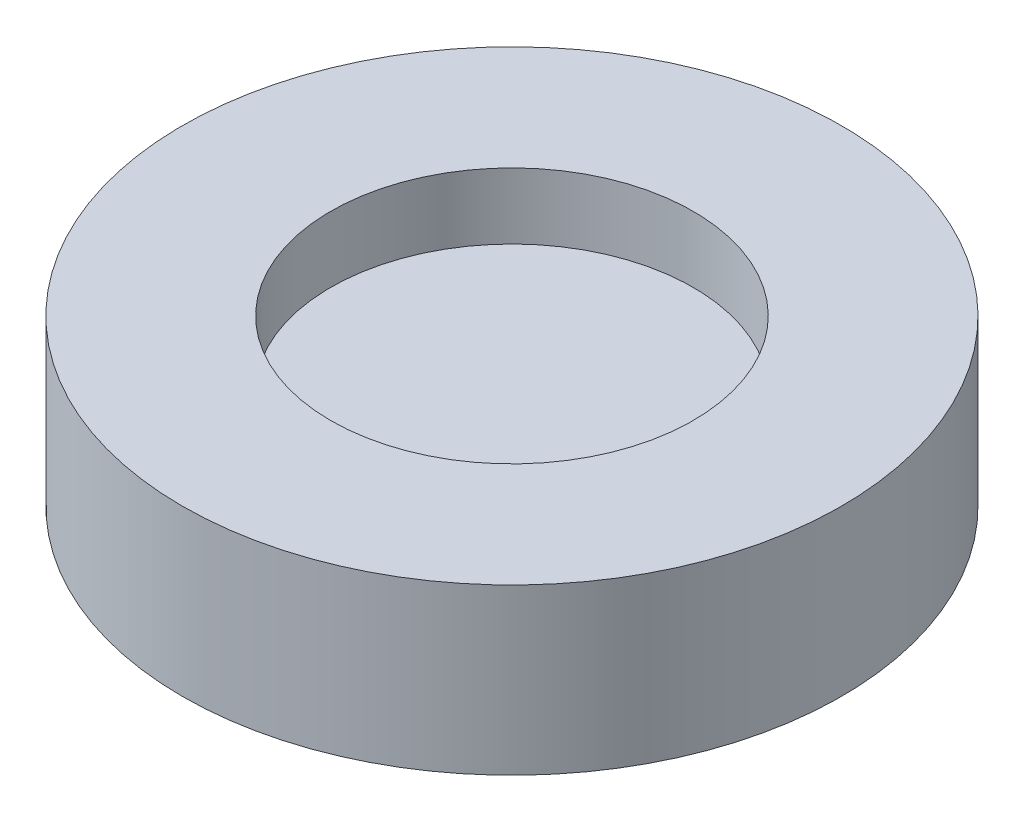
ISO-10303-21;
HEADER;
FILE_DESCRIPTION(('STEP AP214'),'2;1');
FILE_NAME('part.step','',(''),(''),'','','');
FILE_SCHEMA(('AUTOMOTIVE_DESIGN { 1 0 10303 214 1 1 1 1 }'));
ENDSEC;
DATA;
#1=APPLICATION_CONTEXT('core data for automotive mechanical design processes');
#2=APPLICATION_PROTOCOL_DEFINITION('international standard','automotive_design',2000,#1);
#3=PRODUCT_CONTEXT('',#1,'mechanical');
#4=PRODUCT('Part','Part','',(#3));
#5=PRODUCT_RELATED_PRODUCT_CATEGORY('part','',(#4));
#6=PRODUCT_DEFINITION_FORMATION('','',#4);
#7=PRODUCT_DEFINITION_CONTEXT('part definition',#1,'design');
#8=PRODUCT_DEFINITION('design','',#6,#7);
#9=PRODUCT_DEFINITION_SHAPE('','',#8);
#10=(LENGTH_UNIT() NAMED_UNIT(*) SI_UNIT(.MILLI.,.METRE.));
#11=(NAMED_UNIT(*) PLANE_ANGLE_UNIT() SI_UNIT($,.RADIAN.));
#12=(NAMED_UNIT(*) SI_UNIT($,.STERADIAN.) SOLID_ANGLE_UNIT());
#13=UNCERTAINTY_MEASURE_WITH_UNIT(LENGTH_MEASURE(1.E-05),#10,'distance_accuracy_value','');
#14=(GEOMETRIC_REPRESENTATION_CONTEXT(3) GLOBAL_UNCERTAINTY_ASSIGNED_CONTEXT((#13)) GLOBAL_UNIT_ASSIGNED_CONTEXT((#10,
#11,#12)) REPRESENTATION_CONTEXT('',''));
#15=CARTESIAN_POINT('',(0.,0.,0.));
#16=DIRECTION('',(0.,0.,1.));
#17=DIRECTION('',(1.,0.,0.));
#18=AXIS2_PLACEMENT_3D('',#15,#16,#17);
#19=CARTESIAN_POINT('',(0.,5.,0.));
#20=DIRECTION('',(0.,-1.,0.));
#21=DIRECTION('',(0.,0.,-1.));
#22=AXIS2_PLACEMENT_3D('',#19,#20,#21);
#23=CYLINDRICAL_SURFACE('',#22,10.);
#24=CARTESIAN_POINT('',(0.,5.,0.));
#25=DIRECTION('',(0.,1.,0.));
#26=DIRECTION('',(0.,0.,1.));
#27=AXIS2_PLACEMENT_3D('',#24,#25,#26);
#28=CIRCLE('',#27,10.);
#29=CARTESIAN_POINT('',(0.,5.,10.));
#30=VERTEX_POINT('',#29);
#31=EDGE_CURVE('E41',#30,#30,#28,.T.);
#32=ORIENTED_EDGE('',*,*,#31,.F.);
#33=EDGE_LOOP('',(#32));
#34=FACE_BOUND('',#33,.T.);
#35=CARTESIAN_POINT('',(0.,0.,0.));
#36=DIRECTION('',(0.,1.,0.));
#37=DIRECTION('',(0.,0.,1.));
#38=AXIS2_PLACEMENT_3D('',#35,#36,#37);
#39=CIRCLE('',#38,10.);
#40=CARTESIAN_POINT('',(0.,0.,10.));
#41=VERTEX_POINT('',#40);
#42=EDGE_CURVE('E45',#41,#41,#39,.T.);
#43=ORIENTED_EDGE('',*,*,#42,.T.);
#44=EDGE_LOOP('',(#43));
#45=FACE_BOUND('',#44,.T.);
#46=ADVANCED_FACE('F30',(#34,#45),#23,.T.);
#47=CARTESIAN_POINT('',(0.,5.,0.));
#48=DIRECTION('',(0.,1.,0.));
#49=DIRECTION('',(0.,0.,1.));
#50=AXIS2_PLACEMENT_3D('',#47,#48,#49);
#51=PLANE('',#50);
#52=CARTESIAN_POINT('',(0.,5.,0.));
#53=DIRECTION('',(0.,1.,0.));
#54=DIRECTION('',(0.,0.,1.));
#55=AXIS2_PLACEMENT_3D('',#52,#53,#54);
#56=CIRCLE('',#55,5.5);
#57=CARTESIAN_POINT('',(0.,5.,5.5));
#58=VERTEX_POINT('',#57);
#59=EDGE_CURVE('E51',#58,#58,#56,.T.);
#60=ORIENTED_EDGE('',*,*,#59,.F.);
#61=EDGE_LOOP('',(#60));
#62=FACE_BOUND('',#61,.T.);
#63=ORIENTED_EDGE('',*,*,#31,.T.);
#64=EDGE_LOOP('',(#63));
#65=FACE_BOUND('',#64,.T.);
#66=ADVANCED_FACE('F66',(#62,#65),#51,.T.);
#67=CARTESIAN_POINT('',(0.,0.,0.));
#68=DIRECTION('',(0.,1.,0.));
#69=DIRECTION('',(0.,0.,1.));
#70=AXIS2_PLACEMENT_3D('',#67,#68,#69);
#71=PLANE('',#70);
#72=CARTESIAN_POINT('',(0.,0.,0.));
#73=DIRECTION('',(0.,-1.,0.));
#74=DIRECTION('',(0.,0.,-1.));
#75=AXIS2_PLACEMENT_3D('',#72,#73,#74);
#76=CIRCLE('',#75,1.25);
#77=CARTESIAN_POINT('',(0.,0.,-1.25));
#78=VERTEX_POINT('',#77);
#79=EDGE_CURVE('E54',#78,#78,#76,.T.);
#80=ORIENTED_EDGE('',*,*,#79,.F.);
#81=EDGE_LOOP('',(#80));
#82=FACE_BOUND('',#81,.T.);
#83=ORIENTED_EDGE('',*,*,#42,.F.);
#84=EDGE_LOOP('',(#83));
#85=FACE_BOUND('',#84,.T.);
#86=ADVANCED_FACE('F62',(#82,#85),#71,.F.);
#87=CARTESIAN_POINT('',(0.,3.,0.));
#88=DIRECTION('',(0.,1.,0.));
#89=DIRECTION('',(0.,0.,1.));
#90=AXIS2_PLACEMENT_3D('',#87,#88,#89);
#91=CYLINDRICAL_SURFACE('',#90,5.5);
#92=CARTESIAN_POINT('',(0.,3.,0.));
#93=DIRECTION('',(0.,1.,0.));
#94=DIRECTION('',(0.,0.,1.));
#95=AXIS2_PLACEMENT_3D('',#92,#93,#94);
#96=CIRCLE('',#95,5.5);
#97=CARTESIAN_POINT('',(0.,3.,5.5));
#98=VERTEX_POINT('',#97);
#99=EDGE_CURVE('E49',#98,#98,#96,.T.);
#100=ORIENTED_EDGE('',*,*,#99,.F.);
#101=EDGE_LOOP('',(#100));
#102=FACE_BOUND('',#101,.T.);
#103=ORIENTED_EDGE('',*,*,#59,.T.);
#104=EDGE_LOOP('',(#103));
#105=FACE_BOUND('',#104,.T.);
#106=ADVANCED_FACE('F65',(#102,#105),#91,.F.);
#107=CARTESIAN_POINT('',(0.,3.,0.));
#108=DIRECTION('',(0.,1.,0.));
#109=DIRECTION('',(0.,0.,1.));
#110=AXIS2_PLACEMENT_3D('',#107,#108,#109);
#111=PLANE('',#110);
#112=ORIENTED_EDGE('',*,*,#99,.T.);
#113=EDGE_LOOP('',(#112));
#114=FACE_BOUND('',#113,.T.);
#115=ADVANCED_FACE('F81',(#114),#111,.T.);
#116=CARTESIAN_POINT('',(0.,2.5,0.));
#117=DIRECTION('',(0.,-1.,0.));
#118=DIRECTION('',(0.,0.,-1.));
#119=AXIS2_PLACEMENT_3D('',#116,#117,#118);
#120=CYLINDRICAL_SURFACE('',#119,1.25);
#121=CARTESIAN_POINT('',(0.,1.5,0.));
#122=DIRECTION('',(0.,-1.,0.));
#123=DIRECTION('',(0.,0.,-1.));
#124=AXIS2_PLACEMENT_3D('',#121,#122,#123);
#125=CIRCLE('',#124,1.25);
#126=CARTESIAN_POINT('',(0.,1.5,-1.25));
#127=VERTEX_POINT('',#126);
#128=EDGE_CURVE('E10',#127,#127,#125,.F.);
#129=ORIENTED_EDGE('',*,*,#128,.T.);
#130=EDGE_LOOP('',(#129));
#131=FACE_BOUND('',#130,.T.);
#132=ORIENTED_EDGE('',*,*,#79,.T.);
#133=EDGE_LOOP('',(#132));
#134=FACE_BOUND('',#133,.T.);
#135=ADVANCED_FACE('F60',(#131,#134),#120,.F.);
#136=CARTESIAN_POINT('',(0.,2.5,0.));
#137=DIRECTION('',(0.,-1.,0.));
#138=DIRECTION('',(0.,0.,-1.));
#139=AXIS2_PLACEMENT_3D('',#136,#137,#138);
#140=PLANE('',#139);
#141=CARTESIAN_POINT('',(0.,2.5,0.));
#142=DIRECTION('',(0.,-1.,0.));
#143=DIRECTION('',(0.,0.,-1.));
#144=AXIS2_PLACEMENT_3D('',#141,#142,#143);
#145=CIRCLE('',#144,0.25);
#146=CARTESIAN_POINT('',(0.,2.5,-0.25));
#147=VERTEX_POINT('',#146);
#148=EDGE_CURVE('E37',#147,#147,#145,.T.);
#149=ORIENTED_EDGE('',*,*,#148,.T.);
#150=EDGE_LOOP('',(#149));
#151=FACE_BOUND('',#150,.T.);
#152=ADVANCED_FACE('F88',(#151),#140,.T.);
#153=CARTESIAN_POINT('',(0.,1.5,0.));
#154=DIRECTION('',(0.,-1.,0.));
#155=DIRECTION('',(0.,0.,-1.));
#156=AXIS2_PLACEMENT_3D('',#153,#154,#155);
#157=DEGENERATE_TOROIDAL_SURFACE('',#156,0.25,1.,.T.);
#158=ORIENTED_EDGE('',*,*,#128,.F.);
#159=EDGE_LOOP('',(#158));
#160=FACE_BOUND('',#159,.T.);
#161=ORIENTED_EDGE('',*,*,#148,.F.);
#162=EDGE_LOOP('',(#161));
#163=FACE_BOUND('',#162,.T.);
#164=ADVANCED_FACE('F32',(#160,#163),#157,.F.);
#165=CLOSED_SHELL('',(#46,#66,#86,#106,#115,#135,#152,#164));
#166=MANIFOLD_SOLID_BREP('B2',#165);
#167=ADVANCED_BREP_SHAPE_REPRESENTATION('',(#18,#166),#14);
#168=SHAPE_DEFINITION_REPRESENTATION(#9,#167);
ENDSEC;
END-ISO-10303-21;
